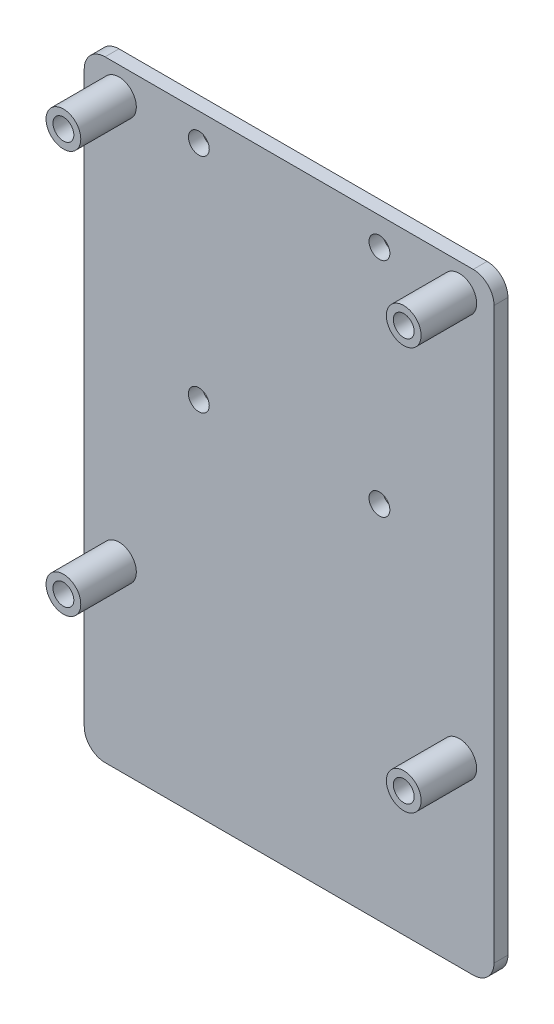
ISO-10303-21;
HEADER;
FILE_DESCRIPTION(('STEP AP214'),'2;1');
FILE_NAME('part.step','',(''),(''),'','','');
FILE_SCHEMA(('AUTOMOTIVE_DESIGN { 1 0 10303 214 1 1 1 1 }'));
ENDSEC;
DATA;
#1=APPLICATION_CONTEXT('core data for automotive mechanical design processes');
#2=APPLICATION_PROTOCOL_DEFINITION('international standard','automotive_design',2000,#1);
#3=PRODUCT_CONTEXT('',#1,'mechanical');
#4=PRODUCT('Part','Part','',(#3));
#5=PRODUCT_RELATED_PRODUCT_CATEGORY('part','',(#4));
#6=PRODUCT_DEFINITION_FORMATION('','',#4);
#7=PRODUCT_DEFINITION_CONTEXT('part definition',#1,'design');
#8=PRODUCT_DEFINITION('design','',#6,#7);
#9=PRODUCT_DEFINITION_SHAPE('','',#8);
#10=(LENGTH_UNIT() NAMED_UNIT(*) SI_UNIT(.MILLI.,.METRE.));
#11=(NAMED_UNIT(*) PLANE_ANGLE_UNIT() SI_UNIT($,.RADIAN.));
#12=(NAMED_UNIT(*) SI_UNIT($,.STERADIAN.) SOLID_ANGLE_UNIT());
#13=UNCERTAINTY_MEASURE_WITH_UNIT(LENGTH_MEASURE(1.E-05),#10,'distance_accuracy_value','');
#14=(GEOMETRIC_REPRESENTATION_CONTEXT(3) GLOBAL_UNCERTAINTY_ASSIGNED_CONTEXT((#13)) GLOBAL_UNIT_ASSIGNED_CONTEXT((#10,
#11,#12)) REPRESENTATION_CONTEXT('',''));
#15=CARTESIAN_POINT('',(0.,0.,0.));
#16=DIRECTION('',(0.,0.,1.));
#17=DIRECTION('',(1.,0.,0.));
#18=AXIS2_PLACEMENT_3D('',#15,#16,#17);
#19=CARTESIAN_POINT('',(29.5,0.,2.));
#20=DIRECTION('',(1.,0.,0.));
#21=DIRECTION('',(0.,1.,0.));
#22=AXIS2_PLACEMENT_3D('',#19,#20,#21);
#23=PLANE('',#22);
#24=DIRECTION('',(0.,-1.,0.));
#25=VECTOR('',#24,1.);
#26=CARTESIAN_POINT('',(29.5,0.,2.));
#27=LINE('',#26,#25);
#28=CARTESIAN_POINT('',(29.5,17.,2.));
#29=VERTEX_POINT('',#28);
#30=CARTESIAN_POINT('',(29.5,-65.,2.));
#31=VERTEX_POINT('',#30);
#32=EDGE_CURVE('E169',#29,#31,#27,.T.);
#33=ORIENTED_EDGE('',*,*,#32,.T.);
#34=DIRECTION('',(0.,0.,-1.));
#35=VECTOR('',#34,1.);
#36=CARTESIAN_POINT('',(29.5,-65.,0.));
#37=LINE('',#36,#35);
#38=CARTESIAN_POINT('',(29.5,-65.,0.));
#39=VERTEX_POINT('',#38);
#40=EDGE_CURVE('E128',#31,#39,#37,.T.);
#41=ORIENTED_EDGE('',*,*,#40,.T.);
#42=DIRECTION('',(0.,-1.,0.));
#43=VECTOR('',#42,1.);
#44=CARTESIAN_POINT('',(29.5,0.,0.));
#45=LINE('',#44,#43);
#46=CARTESIAN_POINT('',(29.5,17.,0.));
#47=VERTEX_POINT('',#46);
#48=EDGE_CURVE('E113',#47,#39,#45,.T.);
#49=ORIENTED_EDGE('',*,*,#48,.F.);
#50=DIRECTION('',(0.,0.,-1.));
#51=VECTOR('',#50,1.);
#52=CARTESIAN_POINT('',(29.5,17.,2.));
#53=LINE('',#52,#51);
#54=EDGE_CURVE('E125',#47,#29,#53,.F.);
#55=ORIENTED_EDGE('',*,*,#54,.T.);
#56=EDGE_LOOP('',(#33,#41,#49,#55));
#57=FACE_BOUND('',#56,.T.);
#58=ADVANCED_FACE('F42',(#57),#23,.T.);
#59=CARTESIAN_POINT('',(0.,20.,2.));
#60=DIRECTION('',(0.,1.,0.));
#61=DIRECTION('',(-1.,0.,0.));
#62=AXIS2_PLACEMENT_3D('',#59,#60,#61);
#63=PLANE('',#62);
#64=DIRECTION('',(1.,0.,0.));
#65=VECTOR('',#64,1.);
#66=CARTESIAN_POINT('',(0.,20.,2.));
#67=LINE('',#66,#65);
#68=CARTESIAN_POINT('',(-26.5,20.,2.));
#69=VERTEX_POINT('',#68);
#70=CARTESIAN_POINT('',(26.5,20.,2.));
#71=VERTEX_POINT('',#70);
#72=EDGE_CURVE('E166',#69,#71,#67,.T.);
#73=ORIENTED_EDGE('',*,*,#72,.T.);
#74=DIRECTION('',(0.,0.,-1.));
#75=VECTOR('',#74,1.);
#76=CARTESIAN_POINT('',(26.5,20.,2.));
#77=LINE('',#76,#75);
#78=CARTESIAN_POINT('',(26.5,20.,0.));
#79=VERTEX_POINT('',#78);
#80=EDGE_CURVE('E11',#71,#79,#77,.T.);
#81=ORIENTED_EDGE('',*,*,#80,.T.);
#82=DIRECTION('',(1.,0.,0.));
#83=VECTOR('',#82,1.);
#84=CARTESIAN_POINT('',(0.,20.,0.));
#85=LINE('',#84,#83);
#86=CARTESIAN_POINT('',(-26.5,20.,0.));
#87=VERTEX_POINT('',#86);
#88=EDGE_CURVE('E115',#87,#79,#85,.T.);
#89=ORIENTED_EDGE('',*,*,#88,.F.);
#90=DIRECTION('',(0.,0.,-1.));
#91=VECTOR('',#90,1.);
#92=CARTESIAN_POINT('',(-26.5,20.,2.));
#93=LINE('',#92,#91);
#94=EDGE_CURVE('E50',#87,#69,#93,.F.);
#95=ORIENTED_EDGE('',*,*,#94,.T.);
#96=EDGE_LOOP('',(#73,#81,#89,#95));
#97=FACE_BOUND('',#96,.T.);
#98=ADVANCED_FACE('F165',(#97),#63,.T.);
#99=CARTESIAN_POINT('',(-29.5,0.,2.));
#100=DIRECTION('',(1.,0.,0.));
#101=DIRECTION('',(0.,1.,0.));
#102=AXIS2_PLACEMENT_3D('',#99,#100,#101);
#103=PLANE('',#102);
#104=DIRECTION('',(0.,-1.,0.));
#105=VECTOR('',#104,1.);
#106=CARTESIAN_POINT('',(-29.5,0.,0.));
#107=LINE('',#106,#105);
#108=CARTESIAN_POINT('',(-29.5,17.,0.));
#109=VERTEX_POINT('',#108);
#110=CARTESIAN_POINT('',(-29.5,-65.,0.));
#111=VERTEX_POINT('',#110);
#112=EDGE_CURVE('E174',#109,#111,#107,.T.);
#113=ORIENTED_EDGE('',*,*,#112,.T.);
#114=DIRECTION('',(0.,0.,-1.));
#115=VECTOR('',#114,1.);
#116=CARTESIAN_POINT('',(-29.5,-65.,2.));
#117=LINE('',#116,#115);
#118=CARTESIAN_POINT('',(-29.5,-65.,2.));
#119=VERTEX_POINT('',#118);
#120=EDGE_CURVE('E57',#111,#119,#117,.F.);
#121=ORIENTED_EDGE('',*,*,#120,.T.);
#122=DIRECTION('',(0.,-1.,0.));
#123=VECTOR('',#122,1.);
#124=CARTESIAN_POINT('',(-29.5,0.,2.));
#125=LINE('',#124,#123);
#126=CARTESIAN_POINT('',(-29.5,17.,2.));
#127=VERTEX_POINT('',#126);
#128=EDGE_CURVE('E138',#127,#119,#125,.T.);
#129=ORIENTED_EDGE('',*,*,#128,.F.);
#130=DIRECTION('',(0.,0.,-1.));
#131=VECTOR('',#130,1.);
#132=CARTESIAN_POINT('',(-29.5,17.,0.));
#133=LINE('',#132,#131);
#134=EDGE_CURVE('E159',#127,#109,#133,.T.);
#135=ORIENTED_EDGE('',*,*,#134,.T.);
#136=EDGE_LOOP('',(#113,#121,#129,#135));
#137=FACE_BOUND('',#136,.T.);
#138=ADVANCED_FACE('F173',(#137),#103,.F.);
#139=CARTESIAN_POINT('',(-13.,-16.,2.));
#140=DIRECTION('',(0.,0.,-1.));
#141=DIRECTION('',(-1.,0.,0.));
#142=AXIS2_PLACEMENT_3D('',#139,#140,#141);
#143=CYLINDRICAL_SURFACE('',#142,1.5);
#144=CARTESIAN_POINT('',(-13.,-16.,2.));
#145=DIRECTION('',(0.,0.,1.));
#146=DIRECTION('',(1.,0.,0.));
#147=AXIS2_PLACEMENT_3D('',#144,#145,#146);
#148=CIRCLE('',#147,1.5);
#149=CARTESIAN_POINT('',(-11.5,-16.,2.));
#150=VERTEX_POINT('',#149);
#151=EDGE_CURVE('E197',#150,#150,#148,.T.);
#152=ORIENTED_EDGE('',*,*,#151,.T.);
#153=EDGE_LOOP('',(#152));
#154=FACE_BOUND('',#153,.T.);
#155=CARTESIAN_POINT('',(-13.,-16.,0.));
#156=DIRECTION('',(0.,0.,1.));
#157=DIRECTION('',(1.,0.,0.));
#158=AXIS2_PLACEMENT_3D('',#155,#156,#157);
#159=CIRCLE('',#158,1.5);
#160=CARTESIAN_POINT('',(-11.5,-16.,0.));
#161=VERTEX_POINT('',#160);
#162=EDGE_CURVE('E129',#161,#161,#159,.T.);
#163=ORIENTED_EDGE('',*,*,#162,.F.);
#164=EDGE_LOOP('',(#163));
#165=FACE_BOUND('',#164,.T.);
#166=ADVANCED_FACE('F280',(#154,#165),#143,.F.);
#167=CARTESIAN_POINT('',(-13.,16.,2.));
#168=DIRECTION('',(0.,0.,-1.));
#169=DIRECTION('',(-1.,0.,0.));
#170=AXIS2_PLACEMENT_3D('',#167,#168,#169);
#171=CYLINDRICAL_SURFACE('',#170,1.5);
#172=CARTESIAN_POINT('',(-13.,16.,2.));
#173=DIRECTION('',(0.,0.,1.));
#174=DIRECTION('',(1.,0.,0.));
#175=AXIS2_PLACEMENT_3D('',#172,#173,#174);
#176=CIRCLE('',#175,1.5);
#177=CARTESIAN_POINT('',(-11.5,16.,2.));
#178=VERTEX_POINT('',#177);
#179=EDGE_CURVE('E200',#178,#178,#176,.T.);
#180=ORIENTED_EDGE('',*,*,#179,.T.);
#181=EDGE_LOOP('',(#180));
#182=FACE_BOUND('',#181,.T.);
#183=CARTESIAN_POINT('',(-13.,16.,0.));
#184=DIRECTION('',(0.,0.,1.));
#185=DIRECTION('',(1.,0.,0.));
#186=AXIS2_PLACEMENT_3D('',#183,#184,#185);
#187=CIRCLE('',#186,1.5);
#188=CARTESIAN_POINT('',(-11.5,16.,0.));
#189=VERTEX_POINT('',#188);
#190=EDGE_CURVE('E182',#189,#189,#187,.T.);
#191=ORIENTED_EDGE('',*,*,#190,.F.);
#192=EDGE_LOOP('',(#191));
#193=FACE_BOUND('',#192,.T.);
#194=ADVANCED_FACE('F283',(#182,#193),#171,.F.);
#195=CARTESIAN_POINT('',(13.,-16.,2.));
#196=DIRECTION('',(0.,0.,-1.));
#197=DIRECTION('',(-1.,0.,0.));
#198=AXIS2_PLACEMENT_3D('',#195,#196,#197);
#199=CYLINDRICAL_SURFACE('',#198,1.5);
#200=CARTESIAN_POINT('',(13.,-16.,2.));
#201=DIRECTION('',(0.,0.,1.));
#202=DIRECTION('',(1.,0.,0.));
#203=AXIS2_PLACEMENT_3D('',#200,#201,#202);
#204=CIRCLE('',#203,1.5);
#205=CARTESIAN_POINT('',(14.5,-16.,2.));
#206=VERTEX_POINT('',#205);
#207=EDGE_CURVE('E203',#206,#206,#204,.T.);
#208=ORIENTED_EDGE('',*,*,#207,.T.);
#209=EDGE_LOOP('',(#208));
#210=FACE_BOUND('',#209,.T.);
#211=CARTESIAN_POINT('',(13.,-16.,0.));
#212=DIRECTION('',(0.,0.,1.));
#213=DIRECTION('',(1.,0.,0.));
#214=AXIS2_PLACEMENT_3D('',#211,#212,#213);
#215=CIRCLE('',#214,1.5);
#216=CARTESIAN_POINT('',(14.5,-16.,0.));
#217=VERTEX_POINT('',#216);
#218=EDGE_CURVE('E185',#217,#217,#215,.T.);
#219=ORIENTED_EDGE('',*,*,#218,.F.);
#220=EDGE_LOOP('',(#219));
#221=FACE_BOUND('',#220,.T.);
#222=ADVANCED_FACE('F287',(#210,#221),#199,.F.);
#223=CARTESIAN_POINT('',(13.,16.,2.));
#224=DIRECTION('',(0.,0.,-1.));
#225=DIRECTION('',(-1.,0.,0.));
#226=AXIS2_PLACEMENT_3D('',#223,#224,#225);
#227=CYLINDRICAL_SURFACE('',#226,1.5);
#228=CARTESIAN_POINT('',(13.,16.,2.));
#229=DIRECTION('',(0.,0.,1.));
#230=DIRECTION('',(1.,0.,0.));
#231=AXIS2_PLACEMENT_3D('',#228,#229,#230);
#232=CIRCLE('',#231,1.5);
#233=CARTESIAN_POINT('',(14.5,16.,2.));
#234=VERTEX_POINT('',#233);
#235=EDGE_CURVE('E177',#234,#234,#232,.T.);
#236=ORIENTED_EDGE('',*,*,#235,.T.);
#237=EDGE_LOOP('',(#236));
#238=FACE_BOUND('',#237,.T.);
#239=CARTESIAN_POINT('',(13.,16.,0.));
#240=DIRECTION('',(0.,0.,1.));
#241=DIRECTION('',(1.,0.,0.));
#242=AXIS2_PLACEMENT_3D('',#239,#240,#241);
#243=CIRCLE('',#242,1.5);
#244=CARTESIAN_POINT('',(14.5,16.,0.));
#245=VERTEX_POINT('',#244);
#246=EDGE_CURVE('E188',#245,#245,#243,.T.);
#247=ORIENTED_EDGE('',*,*,#246,.F.);
#248=EDGE_LOOP('',(#247));
#249=FACE_BOUND('',#248,.T.);
#250=ADVANCED_FACE('F291',(#238,#249),#227,.F.);
#251=CARTESIAN_POINT('',(0.,-68.,2.));
#252=DIRECTION('',(0.,1.,0.));
#253=DIRECTION('',(0.,0.,1.));
#254=AXIS2_PLACEMENT_3D('',#251,#252,#253);
#255=PLANE('',#254);
#256=DIRECTION('',(1.,0.,0.));
#257=VECTOR('',#256,1.);
#258=CARTESIAN_POINT('',(0.,-68.,0.));
#259=LINE('',#258,#257);
#260=CARTESIAN_POINT('',(-26.5,-68.,0.));
#261=VERTEX_POINT('',#260);
#262=CARTESIAN_POINT('',(26.5,-68.,0.));
#263=VERTEX_POINT('',#262);
#264=EDGE_CURVE('E141',#261,#263,#259,.T.);
#265=ORIENTED_EDGE('',*,*,#264,.T.);
#266=DIRECTION('',(0.,0.,-1.));
#267=VECTOR('',#266,1.);
#268=CARTESIAN_POINT('',(26.5,-68.,2.));
#269=LINE('',#268,#267);
#270=CARTESIAN_POINT('',(26.5,-68.,2.));
#271=VERTEX_POINT('',#270);
#272=EDGE_CURVE('E151',#263,#271,#269,.F.);
#273=ORIENTED_EDGE('',*,*,#272,.T.);
#274=DIRECTION('',(1.,0.,0.));
#275=VECTOR('',#274,1.);
#276=CARTESIAN_POINT('',(0.,-68.,2.));
#277=LINE('',#276,#275);
#278=CARTESIAN_POINT('',(-26.5,-68.,2.));
#279=VERTEX_POINT('',#278);
#280=EDGE_CURVE('E134',#279,#271,#277,.T.);
#281=ORIENTED_EDGE('',*,*,#280,.F.);
#282=DIRECTION('',(0.,0.,-1.));
#283=VECTOR('',#282,1.);
#284=CARTESIAN_POINT('',(-26.5,-68.,2.));
#285=LINE('',#284,#283);
#286=EDGE_CURVE('E148',#279,#261,#285,.T.);
#287=ORIENTED_EDGE('',*,*,#286,.T.);
#288=EDGE_LOOP('',(#265,#273,#281,#287));
#289=FACE_BOUND('',#288,.T.);
#290=ADVANCED_FACE('F295',(#289),#255,.F.);
#291=CARTESIAN_POINT('',(0.,0.,2.));
#292=DIRECTION('',(0.,0.,1.));
#293=DIRECTION('',(1.,0.,0.));
#294=AXIS2_PLACEMENT_3D('',#291,#292,#293);
#295=PLANE('',#294);
#296=ORIENTED_EDGE('',*,*,#235,.F.);
#297=EDGE_LOOP('',(#296));
#298=FACE_BOUND('',#297,.T.);
#299=CARTESIAN_POINT('',(24.5,-42.,2.));
#300=DIRECTION('',(0.,0.,1.));
#301=DIRECTION('',(1.,0.,0.));
#302=AXIS2_PLACEMENT_3D('',#299,#300,#301);
#303=CIRCLE('',#302,2.5);
#304=CARTESIAN_POINT('',(27.,-42.,2.));
#305=VERTEX_POINT('',#304);
#306=EDGE_CURVE('E212',#305,#305,#303,.T.);
#307=ORIENTED_EDGE('',*,*,#306,.F.);
#308=EDGE_LOOP('',(#307));
#309=FACE_BOUND('',#308,.T.);
#310=CARTESIAN_POINT('',(-24.5,-42.,2.));
#311=DIRECTION('',(0.,0.,1.));
#312=DIRECTION('',(1.,0.,0.));
#313=AXIS2_PLACEMENT_3D('',#310,#311,#312);
#314=CIRCLE('',#313,2.5);
#315=CARTESIAN_POINT('',(-22.,-42.,2.));
#316=VERTEX_POINT('',#315);
#317=EDGE_CURVE('E209',#316,#316,#314,.T.);
#318=ORIENTED_EDGE('',*,*,#317,.F.);
#319=EDGE_LOOP('',(#318));
#320=FACE_BOUND('',#319,.T.);
#321=CARTESIAN_POINT('',(24.5,16.,2.));
#322=DIRECTION('',(0.,0.,1.));
#323=DIRECTION('',(1.,0.,0.));
#324=AXIS2_PLACEMENT_3D('',#321,#322,#323);
#325=CIRCLE('',#324,2.5);
#326=CARTESIAN_POINT('',(27.,16.,2.));
#327=VERTEX_POINT('',#326);
#328=EDGE_CURVE('E206',#327,#327,#325,.T.);
#329=ORIENTED_EDGE('',*,*,#328,.F.);
#330=EDGE_LOOP('',(#329));
#331=FACE_BOUND('',#330,.T.);
#332=ORIENTED_EDGE('',*,*,#207,.F.);
#333=EDGE_LOOP('',(#332));
#334=FACE_BOUND('',#333,.T.);
#335=ORIENTED_EDGE('',*,*,#179,.F.);
#336=EDGE_LOOP('',(#335));
#337=FACE_BOUND('',#336,.T.);
#338=ORIENTED_EDGE('',*,*,#151,.F.);
#339=EDGE_LOOP('',(#338));
#340=FACE_BOUND('',#339,.T.);
#341=CARTESIAN_POINT('',(-24.5,16.,2.));
#342=DIRECTION('',(0.,0.,1.));
#343=DIRECTION('',(1.,0.,0.));
#344=AXIS2_PLACEMENT_3D('',#341,#342,#343);
#345=CIRCLE('',#344,2.5);
#346=CARTESIAN_POINT('',(-22.,16.,2.));
#347=VERTEX_POINT('',#346);
#348=EDGE_CURVE('E194',#347,#347,#345,.T.);
#349=ORIENTED_EDGE('',*,*,#348,.F.);
#350=EDGE_LOOP('',(#349));
#351=FACE_BOUND('',#350,.T.);
#352=ORIENTED_EDGE('',*,*,#280,.T.);
#353=CARTESIAN_POINT('',(26.5,-65.,2.));
#354=DIRECTION('',(0.,0.,1.));
#355=DIRECTION('',(1.,0.,0.));
#356=AXIS2_PLACEMENT_3D('',#353,#354,#355);
#357=CIRCLE('',#356,3.);
#358=EDGE_CURVE('E157',#271,#31,#357,.T.);
#359=ORIENTED_EDGE('',*,*,#358,.T.);
#360=ORIENTED_EDGE('',*,*,#32,.F.);
#361=CARTESIAN_POINT('',(26.5,17.,2.));
#362=DIRECTION('',(0.,0.,1.));
#363=DIRECTION('',(1.,0.,0.));
#364=AXIS2_PLACEMENT_3D('',#361,#362,#363);
#365=CIRCLE('',#364,3.);
#366=EDGE_CURVE('E133',#29,#71,#365,.T.);
#367=ORIENTED_EDGE('',*,*,#366,.T.);
#368=ORIENTED_EDGE('',*,*,#72,.F.);
#369=CARTESIAN_POINT('',(-26.5,17.,2.));
#370=DIRECTION('',(0.,0.,1.));
#371=DIRECTION('',(1.,0.,0.));
#372=AXIS2_PLACEMENT_3D('',#369,#370,#371);
#373=CIRCLE('',#372,3.);
#374=EDGE_CURVE('E64',#69,#127,#373,.T.);
#375=ORIENTED_EDGE('',*,*,#374,.T.);
#376=ORIENTED_EDGE('',*,*,#128,.T.);
#377=CARTESIAN_POINT('',(-26.5,-65.,2.));
#378=DIRECTION('',(0.,0.,1.));
#379=DIRECTION('',(1.,0.,0.));
#380=AXIS2_PLACEMENT_3D('',#377,#378,#379);
#381=CIRCLE('',#380,3.);
#382=EDGE_CURVE('E155',#119,#279,#381,.T.);
#383=ORIENTED_EDGE('',*,*,#382,.T.);
#384=EDGE_LOOP('',(#352,#359,#360,#367,#368,#375,#376,#383));
#385=FACE_BOUND('',#384,.T.);
#386=ADVANCED_FACE('F168',(#298,#309,#320,#331,#334,#337,#340,#351,#385),#295,.T.);
#387=CARTESIAN_POINT('',(0.,0.,0.));
#388=DIRECTION('',(0.,0.,1.));
#389=DIRECTION('',(1.,0.,0.));
#390=AXIS2_PLACEMENT_3D('',#387,#388,#389);
#391=PLANE('',#390);
#392=ORIENTED_EDGE('',*,*,#246,.T.);
#393=EDGE_LOOP('',(#392));
#394=FACE_BOUND('',#393,.T.);
#395=ORIENTED_EDGE('',*,*,#218,.T.);
#396=EDGE_LOOP('',(#395));
#397=FACE_BOUND('',#396,.T.);
#398=ORIENTED_EDGE('',*,*,#190,.T.);
#399=EDGE_LOOP('',(#398));
#400=FACE_BOUND('',#399,.T.);
#401=ORIENTED_EDGE('',*,*,#162,.T.);
#402=EDGE_LOOP('',(#401));
#403=FACE_BOUND('',#402,.T.);
#404=ORIENTED_EDGE('',*,*,#48,.T.);
#405=CARTESIAN_POINT('',(26.5,-65.,0.));
#406=DIRECTION('',(0.,0.,1.));
#407=DIRECTION('',(1.,0.,0.));
#408=AXIS2_PLACEMENT_3D('',#405,#406,#407);
#409=CIRCLE('',#408,3.);
#410=EDGE_CURVE('E146',#39,#263,#409,.F.);
#411=ORIENTED_EDGE('',*,*,#410,.T.);
#412=ORIENTED_EDGE('',*,*,#264,.F.);
#413=CARTESIAN_POINT('',(-26.5,-65.,0.));
#414=DIRECTION('',(0.,0.,1.));
#415=DIRECTION('',(1.,0.,0.));
#416=AXIS2_PLACEMENT_3D('',#413,#414,#415);
#417=CIRCLE('',#416,3.);
#418=EDGE_CURVE('E119',#261,#111,#417,.F.);
#419=ORIENTED_EDGE('',*,*,#418,.T.);
#420=ORIENTED_EDGE('',*,*,#112,.F.);
#421=CARTESIAN_POINT('',(-26.5,17.,0.));
#422=DIRECTION('',(0.,0.,1.));
#423=DIRECTION('',(1.,0.,0.));
#424=AXIS2_PLACEMENT_3D('',#421,#422,#423);
#425=CIRCLE('',#424,3.);
#426=EDGE_CURVE('E120',#109,#87,#425,.F.);
#427=ORIENTED_EDGE('',*,*,#426,.T.);
#428=ORIENTED_EDGE('',*,*,#88,.T.);
#429=CARTESIAN_POINT('',(26.5,17.,0.));
#430=DIRECTION('',(0.,0.,1.));
#431=DIRECTION('',(1.,0.,0.));
#432=AXIS2_PLACEMENT_3D('',#429,#430,#431);
#433=CIRCLE('',#432,3.);
#434=EDGE_CURVE('E109',#79,#47,#433,.F.);
#435=ORIENTED_EDGE('',*,*,#434,.T.);
#436=EDGE_LOOP('',(#404,#411,#412,#419,#420,#427,#428,#435));
#437=FACE_BOUND('',#436,.T.);
#438=CARTESIAN_POINT('',(-24.5,16.,0.));
#439=DIRECTION('',(0.,0.,1.));
#440=DIRECTION('',(1.,0.,0.));
#441=AXIS2_PLACEMENT_3D('',#438,#439,#440);
#442=CIRCLE('',#441,1.5);
#443=CARTESIAN_POINT('',(-23.,16.,0.));
#444=VERTEX_POINT('',#443);
#445=EDGE_CURVE('E217',#444,#444,#442,.T.);
#446=ORIENTED_EDGE('',*,*,#445,.T.);
#447=EDGE_LOOP('',(#446));
#448=FACE_BOUND('',#447,.T.);
#449=CARTESIAN_POINT('',(24.5,16.,0.));
#450=DIRECTION('',(0.,0.,1.));
#451=DIRECTION('',(1.,0.,0.));
#452=AXIS2_PLACEMENT_3D('',#449,#450,#451);
#453=CIRCLE('',#452,1.5);
#454=CARTESIAN_POINT('',(26.,16.,0.));
#455=VERTEX_POINT('',#454);
#456=EDGE_CURVE('E226',#455,#455,#453,.T.);
#457=ORIENTED_EDGE('',*,*,#456,.T.);
#458=EDGE_LOOP('',(#457));
#459=FACE_BOUND('',#458,.T.);
#460=CARTESIAN_POINT('',(-24.5,-42.,0.));
#461=DIRECTION('',(0.,0.,1.));
#462=DIRECTION('',(1.,0.,0.));
#463=AXIS2_PLACEMENT_3D('',#460,#461,#462);
#464=CIRCLE('',#463,1.5);
#465=CARTESIAN_POINT('',(-23.,-42.,0.));
#466=VERTEX_POINT('',#465);
#467=EDGE_CURVE('E235',#466,#466,#464,.T.);
#468=ORIENTED_EDGE('',*,*,#467,.T.);
#469=EDGE_LOOP('',(#468));
#470=FACE_BOUND('',#469,.T.);
#471=CARTESIAN_POINT('',(24.5,-42.,0.));
#472=DIRECTION('',(0.,0.,1.));
#473=DIRECTION('',(1.,0.,0.));
#474=AXIS2_PLACEMENT_3D('',#471,#472,#473);
#475=CIRCLE('',#474,1.5);
#476=CARTESIAN_POINT('',(26.,-42.,0.));
#477=VERTEX_POINT('',#476);
#478=EDGE_CURVE('E244',#477,#477,#475,.T.);
#479=ORIENTED_EDGE('',*,*,#478,.T.);
#480=EDGE_LOOP('',(#479));
#481=FACE_BOUND('',#480,.T.);
#482=ADVANCED_FACE('F111',(#394,#397,#400,#403,#437,#448,#459,#470,#481),#391,.F.);
#483=CARTESIAN_POINT('',(-24.5,16.,10.));
#484=DIRECTION('',(0.,0.,-1.));
#485=DIRECTION('',(-1.,0.,0.));
#486=AXIS2_PLACEMENT_3D('',#483,#484,#485);
#487=CYLINDRICAL_SURFACE('',#486,2.5);
#488=ORIENTED_EDGE('',*,*,#348,.T.);
#489=EDGE_LOOP('',(#488));
#490=FACE_BOUND('',#489,.T.);
#491=CARTESIAN_POINT('',(-24.5,16.,10.));
#492=DIRECTION('',(0.,0.,1.));
#493=DIRECTION('',(1.,0.,0.));
#494=AXIS2_PLACEMENT_3D('',#491,#492,#493);
#495=CIRCLE('',#494,2.5);
#496=CARTESIAN_POINT('',(-22.,16.,10.));
#497=VERTEX_POINT('',#496);
#498=EDGE_CURVE('E220',#497,#497,#495,.T.);
#499=ORIENTED_EDGE('',*,*,#498,.F.);
#500=EDGE_LOOP('',(#499));
#501=FACE_BOUND('',#500,.T.);
#502=ADVANCED_FACE('F339',(#490,#501),#487,.T.);
#503=CARTESIAN_POINT('',(-24.5,16.,10.));
#504=DIRECTION('',(0.,0.,-1.));
#505=DIRECTION('',(-1.,0.,0.));
#506=AXIS2_PLACEMENT_3D('',#503,#504,#505);
#507=CYLINDRICAL_SURFACE('',#506,1.5);
#508=CARTESIAN_POINT('',(-24.5,16.,10.));
#509=DIRECTION('',(0.,0.,1.));
#510=DIRECTION('',(1.,0.,0.));
#511=AXIS2_PLACEMENT_3D('',#508,#509,#510);
#512=CIRCLE('',#511,1.5);
#513=CARTESIAN_POINT('',(-23.,16.,10.));
#514=VERTEX_POINT('',#513);
#515=EDGE_CURVE('E190',#514,#514,#512,.T.);
#516=ORIENTED_EDGE('',*,*,#515,.T.);
#517=EDGE_LOOP('',(#516));
#518=FACE_BOUND('',#517,.T.);
#519=ORIENTED_EDGE('',*,*,#445,.F.);
#520=EDGE_LOOP('',(#519));
#521=FACE_BOUND('',#520,.T.);
#522=ADVANCED_FACE('F480',(#518,#521),#507,.F.);
#523=CARTESIAN_POINT('',(0.,0.,10.));
#524=DIRECTION('',(0.,0.,1.));
#525=DIRECTION('',(1.,0.,0.));
#526=AXIS2_PLACEMENT_3D('',#523,#524,#525);
#527=PLANE('',#526);
#528=ORIENTED_EDGE('',*,*,#498,.T.);
#529=EDGE_LOOP('',(#528));
#530=FACE_BOUND('',#529,.T.);
#531=ORIENTED_EDGE('',*,*,#515,.F.);
#532=EDGE_LOOP('',(#531));
#533=FACE_BOUND('',#532,.T.);
#534=ADVANCED_FACE('F469',(#530,#533),#527,.T.);
#535=CARTESIAN_POINT('',(24.5,16.,10.));
#536=DIRECTION('',(0.,0.,-1.));
#537=DIRECTION('',(-1.,0.,0.));
#538=AXIS2_PLACEMENT_3D('',#535,#536,#537);
#539=CYLINDRICAL_SURFACE('',#538,2.5);
#540=ORIENTED_EDGE('',*,*,#328,.T.);
#541=EDGE_LOOP('',(#540));
#542=FACE_BOUND('',#541,.T.);
#543=CARTESIAN_POINT('',(24.5,16.,10.));
#544=DIRECTION('',(0.,0.,1.));
#545=DIRECTION('',(1.,0.,0.));
#546=AXIS2_PLACEMENT_3D('',#543,#544,#545);
#547=CIRCLE('',#546,2.5);
#548=CARTESIAN_POINT('',(27.,16.,10.));
#549=VERTEX_POINT('',#548);
#550=EDGE_CURVE('E229',#549,#549,#547,.T.);
#551=ORIENTED_EDGE('',*,*,#550,.F.);
#552=EDGE_LOOP('',(#551));
#553=FACE_BOUND('',#552,.T.);
#554=ADVANCED_FACE('F458',(#542,#553),#539,.T.);
#555=CARTESIAN_POINT('',(24.5,16.,10.));
#556=DIRECTION('',(0.,0.,-1.));
#557=DIRECTION('',(-1.,0.,0.));
#558=AXIS2_PLACEMENT_3D('',#555,#556,#557);
#559=CYLINDRICAL_SURFACE('',#558,1.5);
#560=CARTESIAN_POINT('',(24.5,16.,10.));
#561=DIRECTION('',(0.,0.,1.));
#562=DIRECTION('',(1.,0.,0.));
#563=AXIS2_PLACEMENT_3D('',#560,#561,#562);
#564=CIRCLE('',#563,1.5);
#565=CARTESIAN_POINT('',(26.,16.,10.));
#566=VERTEX_POINT('',#565);
#567=EDGE_CURVE('E221',#566,#566,#564,.T.);
#568=ORIENTED_EDGE('',*,*,#567,.T.);
#569=EDGE_LOOP('',(#568));
#570=FACE_BOUND('',#569,.T.);
#571=ORIENTED_EDGE('',*,*,#456,.F.);
#572=EDGE_LOOP('',(#571));
#573=FACE_BOUND('',#572,.T.);
#574=ADVANCED_FACE('F447',(#570,#573),#559,.F.);
#575=CARTESIAN_POINT('',(0.,0.,10.));
#576=DIRECTION('',(0.,0.,1.));
#577=DIRECTION('',(1.,0.,0.));
#578=AXIS2_PLACEMENT_3D('',#575,#576,#577);
#579=PLANE('',#578);
#580=ORIENTED_EDGE('',*,*,#550,.T.);
#581=EDGE_LOOP('',(#580));
#582=FACE_BOUND('',#581,.T.);
#583=ORIENTED_EDGE('',*,*,#567,.F.);
#584=EDGE_LOOP('',(#583));
#585=FACE_BOUND('',#584,.T.);
#586=ADVANCED_FACE('F436',(#582,#585),#579,.T.);
#587=CARTESIAN_POINT('',(-24.5,-42.,10.));
#588=DIRECTION('',(0.,0.,-1.));
#589=DIRECTION('',(-1.,0.,0.));
#590=AXIS2_PLACEMENT_3D('',#587,#588,#589);
#591=CYLINDRICAL_SURFACE('',#590,2.5);
#592=ORIENTED_EDGE('',*,*,#317,.T.);
#593=EDGE_LOOP('',(#592));
#594=FACE_BOUND('',#593,.T.);
#595=CARTESIAN_POINT('',(-24.5,-42.,10.));
#596=DIRECTION('',(0.,0.,1.));
#597=DIRECTION('',(1.,0.,0.));
#598=AXIS2_PLACEMENT_3D('',#595,#596,#597);
#599=CIRCLE('',#598,2.5);
#600=CARTESIAN_POINT('',(-22.,-42.,10.));
#601=VERTEX_POINT('',#600);
#602=EDGE_CURVE('E238',#601,#601,#599,.T.);
#603=ORIENTED_EDGE('',*,*,#602,.F.);
#604=EDGE_LOOP('',(#603));
#605=FACE_BOUND('',#604,.T.);
#606=ADVANCED_FACE('F425',(#594,#605),#591,.T.);
#607=CARTESIAN_POINT('',(-24.5,-42.,10.));
#608=DIRECTION('',(0.,0.,-1.));
#609=DIRECTION('',(-1.,0.,0.));
#610=AXIS2_PLACEMENT_3D('',#607,#608,#609);
#611=CYLINDRICAL_SURFACE('',#610,1.5);
#612=CARTESIAN_POINT('',(-24.5,-42.,10.));
#613=DIRECTION('',(0.,0.,1.));
#614=DIRECTION('',(1.,0.,0.));
#615=AXIS2_PLACEMENT_3D('',#612,#613,#614);
#616=CIRCLE('',#615,1.5);
#617=CARTESIAN_POINT('',(-23.,-42.,10.));
#618=VERTEX_POINT('',#617);
#619=EDGE_CURVE('E230',#618,#618,#616,.T.);
#620=ORIENTED_EDGE('',*,*,#619,.T.);
#621=EDGE_LOOP('',(#620));
#622=FACE_BOUND('',#621,.T.);
#623=ORIENTED_EDGE('',*,*,#467,.F.);
#624=EDGE_LOOP('',(#623));
#625=FACE_BOUND('',#624,.T.);
#626=ADVANCED_FACE('F414',(#622,#625),#611,.F.);
#627=CARTESIAN_POINT('',(0.,0.,10.));
#628=DIRECTION('',(0.,0.,1.));
#629=DIRECTION('',(1.,0.,0.));
#630=AXIS2_PLACEMENT_3D('',#627,#628,#629);
#631=PLANE('',#630);
#632=ORIENTED_EDGE('',*,*,#602,.T.);
#633=EDGE_LOOP('',(#632));
#634=FACE_BOUND('',#633,.T.);
#635=ORIENTED_EDGE('',*,*,#619,.F.);
#636=EDGE_LOOP('',(#635));
#637=FACE_BOUND('',#636,.T.);
#638=ADVANCED_FACE('F270',(#634,#637),#631,.T.);
#639=CARTESIAN_POINT('',(24.5,-42.,10.));
#640=DIRECTION('',(0.,0.,-1.));
#641=DIRECTION('',(-1.,0.,0.));
#642=AXIS2_PLACEMENT_3D('',#639,#640,#641);
#643=CYLINDRICAL_SURFACE('',#642,1.5);
#644=CARTESIAN_POINT('',(24.5,-42.,10.));
#645=DIRECTION('',(0.,0.,1.));
#646=DIRECTION('',(1.,0.,0.));
#647=AXIS2_PLACEMENT_3D('',#644,#645,#646);
#648=CIRCLE('',#647,1.5);
#649=CARTESIAN_POINT('',(26.,-42.,10.));
#650=VERTEX_POINT('',#649);
#651=EDGE_CURVE('E247',#650,#650,#648,.T.);
#652=ORIENTED_EDGE('',*,*,#651,.T.);
#653=EDGE_LOOP('',(#652));
#654=FACE_BOUND('',#653,.T.);
#655=ORIENTED_EDGE('',*,*,#478,.F.);
#656=EDGE_LOOP('',(#655));
#657=FACE_BOUND('',#656,.T.);
#658=ADVANCED_FACE('F253',(#654,#657),#643,.F.);
#659=CARTESIAN_POINT('',(24.5,-42.,10.));
#660=DIRECTION('',(0.,0.,-1.));
#661=DIRECTION('',(-1.,0.,0.));
#662=AXIS2_PLACEMENT_3D('',#659,#660,#661);
#663=CYLINDRICAL_SURFACE('',#662,2.5);
#664=ORIENTED_EDGE('',*,*,#306,.T.);
#665=EDGE_LOOP('',(#664));
#666=FACE_BOUND('',#665,.T.);
#667=CARTESIAN_POINT('',(24.5,-42.,10.));
#668=DIRECTION('',(0.,0.,1.));
#669=DIRECTION('',(1.,0.,0.));
#670=AXIS2_PLACEMENT_3D('',#667,#668,#669);
#671=CIRCLE('',#670,2.5);
#672=CARTESIAN_POINT('',(27.,-42.,10.));
#673=VERTEX_POINT('',#672);
#674=EDGE_CURVE('E239',#673,#673,#671,.T.);
#675=ORIENTED_EDGE('',*,*,#674,.F.);
#676=EDGE_LOOP('',(#675));
#677=FACE_BOUND('',#676,.T.);
#678=ADVANCED_FACE('F260',(#666,#677),#663,.T.);
#679=CARTESIAN_POINT('',(0.,0.,10.));
#680=DIRECTION('',(0.,0.,1.));
#681=DIRECTION('',(1.,0.,0.));
#682=AXIS2_PLACEMENT_3D('',#679,#680,#681);
#683=PLANE('',#682);
#684=ORIENTED_EDGE('',*,*,#651,.F.);
#685=EDGE_LOOP('',(#684));
#686=FACE_BOUND('',#685,.T.);
#687=ORIENTED_EDGE('',*,*,#674,.T.);
#688=EDGE_LOOP('',(#687));
#689=FACE_BOUND('',#688,.T.);
#690=ADVANCED_FACE('F256',(#686,#689),#683,.T.);
#691=CARTESIAN_POINT('',(26.5,-65.,2.));
#692=DIRECTION('',(0.,0.,1.));
#693=DIRECTION('',(1.,0.,0.));
#694=AXIS2_PLACEMENT_3D('',#691,#692,#693);
#695=CYLINDRICAL_SURFACE('',#694,3.);
#696=ORIENTED_EDGE('',*,*,#358,.F.);
#697=ORIENTED_EDGE('',*,*,#272,.F.);
#698=ORIENTED_EDGE('',*,*,#410,.F.);
#699=ORIENTED_EDGE('',*,*,#40,.F.);
#700=EDGE_LOOP('',(#696,#697,#698,#699));
#701=FACE_BOUND('',#700,.T.);
#702=ADVANCED_FACE('F259',(#701),#695,.T.);
#703=CARTESIAN_POINT('',(-26.5,-65.,2.));
#704=DIRECTION('',(0.,0.,-1.));
#705=DIRECTION('',(-1.,0.,0.));
#706=AXIS2_PLACEMENT_3D('',#703,#704,#705);
#707=CYLINDRICAL_SURFACE('',#706,3.);
#708=ORIENTED_EDGE('',*,*,#382,.F.);
#709=ORIENTED_EDGE('',*,*,#120,.F.);
#710=ORIENTED_EDGE('',*,*,#418,.F.);
#711=ORIENTED_EDGE('',*,*,#286,.F.);
#712=EDGE_LOOP('',(#708,#709,#710,#711));
#713=FACE_BOUND('',#712,.T.);
#714=ADVANCED_FACE('F299',(#713),#707,.T.);
#715=CARTESIAN_POINT('',(26.5,17.,2.));
#716=DIRECTION('',(0.,0.,-1.));
#717=DIRECTION('',(-1.,0.,0.));
#718=AXIS2_PLACEMENT_3D('',#715,#716,#717);
#719=CYLINDRICAL_SURFACE('',#718,3.);
#720=ORIENTED_EDGE('',*,*,#366,.F.);
#721=ORIENTED_EDGE('',*,*,#54,.F.);
#722=ORIENTED_EDGE('',*,*,#434,.F.);
#723=ORIENTED_EDGE('',*,*,#80,.F.);
#724=EDGE_LOOP('',(#720,#721,#722,#723));
#725=FACE_BOUND('',#724,.T.);
#726=ADVANCED_FACE('F132',(#725),#719,.T.);
#727=CARTESIAN_POINT('',(-26.5,17.,2.));
#728=DIRECTION('',(0.,0.,1.));
#729=DIRECTION('',(1.,0.,0.));
#730=AXIS2_PLACEMENT_3D('',#727,#728,#729);
#731=CYLINDRICAL_SURFACE('',#730,3.);
#732=ORIENTED_EDGE('',*,*,#374,.F.);
#733=ORIENTED_EDGE('',*,*,#94,.F.);
#734=ORIENTED_EDGE('',*,*,#426,.F.);
#735=ORIENTED_EDGE('',*,*,#134,.F.);
#736=EDGE_LOOP('',(#732,#733,#734,#735));
#737=FACE_BOUND('',#736,.T.);
#738=ADVANCED_FACE('F44',(#737),#731,.T.);
#739=CLOSED_SHELL('',(#58,#98,#138,#166,#194,#222,#250,#290,#386,#482,#502,#522,#534,#554,#574,
#586,#606,#626,#638,#658,#678,#690,#702,#714,#726,#738));
#740=MANIFOLD_SOLID_BREP('B2',#739);
#741=ADVANCED_BREP_SHAPE_REPRESENTATION('',(#18,#740),#14);
#742=SHAPE_DEFINITION_REPRESENTATION(#9,#741);
ENDSEC;
END-ISO-10303-21;
